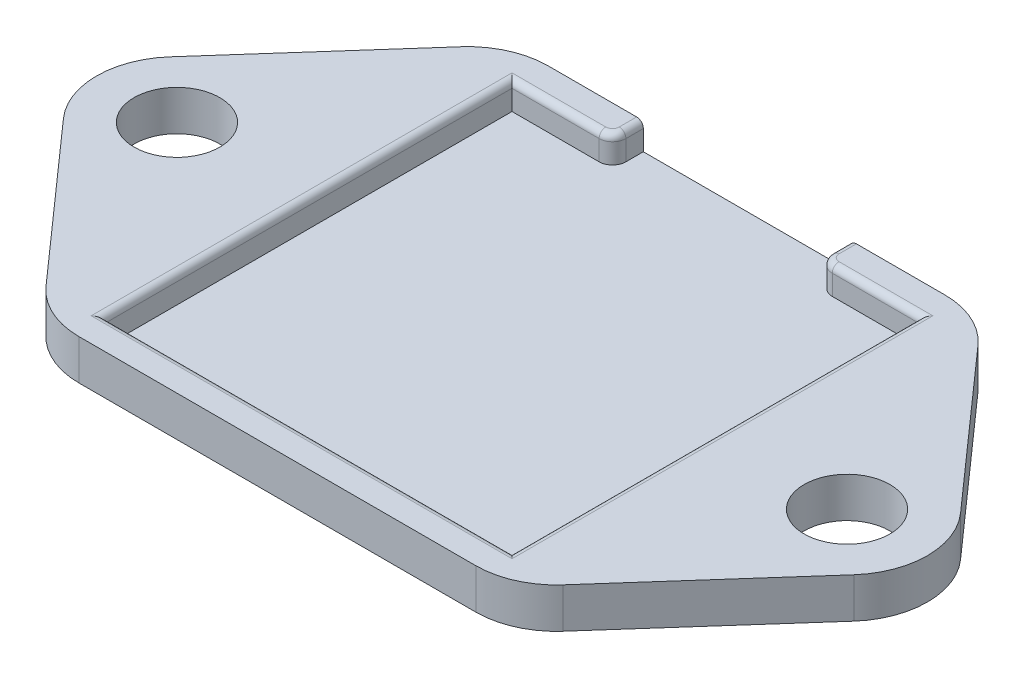
ISO-10303-21;
HEADER;
FILE_DESCRIPTION(('STEP AP214'),'2;1');
FILE_NAME('part.step','',(''),(''),'','','');
FILE_SCHEMA(('AUTOMOTIVE_DESIGN { 1 0 10303 214 1 1 1 1 }'));
ENDSEC;
DATA;
#1=APPLICATION_CONTEXT('core data for automotive mechanical design processes');
#2=APPLICATION_PROTOCOL_DEFINITION('international standard','automotive_design',2000,#1);
#3=PRODUCT_CONTEXT('',#1,'mechanical');
#4=PRODUCT('Part','Part','',(#3));
#5=PRODUCT_RELATED_PRODUCT_CATEGORY('part','',(#4));
#6=PRODUCT_DEFINITION_FORMATION('','',#4);
#7=PRODUCT_DEFINITION_CONTEXT('part definition',#1,'design');
#8=PRODUCT_DEFINITION('design','',#6,#7);
#9=PRODUCT_DEFINITION_SHAPE('','',#8);
#10=(LENGTH_UNIT() NAMED_UNIT(*) SI_UNIT(.MILLI.,.METRE.));
#11=(NAMED_UNIT(*) PLANE_ANGLE_UNIT() SI_UNIT($,.RADIAN.));
#12=(NAMED_UNIT(*) SI_UNIT($,.STERADIAN.) SOLID_ANGLE_UNIT());
#13=UNCERTAINTY_MEASURE_WITH_UNIT(LENGTH_MEASURE(1.E-05),#10,'distance_accuracy_value','');
#14=(GEOMETRIC_REPRESENTATION_CONTEXT(3) GLOBAL_UNCERTAINTY_ASSIGNED_CONTEXT((#13)) GLOBAL_UNIT_ASSIGNED_CONTEXT((#10,
#11,#12)) REPRESENTATION_CONTEXT('',''));
#15=CARTESIAN_POINT('',(0.,0.,0.));
#16=DIRECTION('',(0.,0.,1.));
#17=DIRECTION('',(1.,0.,0.));
#18=AXIS2_PLACEMENT_3D('',#15,#16,#17);
#19=CARTESIAN_POINT('',(25.,3.,0.));
#20=DIRECTION('',(0.,-1.,0.));
#21=DIRECTION('',(0.,0.,-1.));
#22=AXIS2_PLACEMENT_3D('',#19,#20,#21);
#23=PLANE('',#22);
#24=CARTESIAN_POINT('',(-8.7,3.,-16.2));
#25=DIRECTION('',(0.,-1.,0.));
#26=DIRECTION('',(0.,0.,-1.));
#27=AXIS2_PLACEMENT_3D('',#24,#25,#26);
#28=CIRCLE('',#27,0.5);
#29=CARTESIAN_POINT('',(-8.7,3.,-15.7));
#30=VERTEX_POINT('',#29);
#31=CARTESIAN_POINT('',(-8.2,3.,-16.2));
#32=VERTEX_POINT('',#31);
#33=EDGE_CURVE('E479',#30,#32,#28,.F.);
#34=ORIENTED_EDGE('',*,*,#33,.T.);
#35=DIRECTION('',(0.,0.,1.));
#36=VECTOR('',#35,1.);
#37=CARTESIAN_POINT('',(-8.2,3.,0.));
#38=LINE('',#37,#36);
#39=CARTESIAN_POINT('',(-8.2,3.,-17.5));
#40=VERTEX_POINT('',#39);
#41=EDGE_CURVE('E482',#32,#40,#38,.F.);
#42=ORIENTED_EDGE('',*,*,#41,.T.);
#43=DIRECTION('',(-1.,0.,0.));
#44=VECTOR('',#43,1.);
#45=CARTESIAN_POINT('',(-17.5,3.,-17.5));
#46=LINE('',#45,#44);
#47=CARTESIAN_POINT('',(-14.8014525107423,3.,-17.5));
#48=VERTEX_POINT('',#47);
#49=EDGE_CURVE('E314',#40,#48,#46,.T.);
#50=ORIENTED_EDGE('',*,*,#49,.T.);
#51=CARTESIAN_POINT('',(-14.8014525107423,3.,-11.5));
#52=DIRECTION('',(0.,-1.,0.));
#53=DIRECTION('',(0.,0.,-1.));
#54=AXIS2_PLACEMENT_3D('',#51,#52,#53);
#55=CIRCLE('',#54,6.);
#56=CARTESIAN_POINT('',(-19.2904943175209,3.,-15.4810179171908));
#57=VERTEX_POINT('',#56);
#58=EDGE_CURVE('E405',#48,#57,#55,.F.);
#59=ORIENTED_EDGE('',*,*,#58,.T.);
#60=DIRECTION('',(-0.663502986198468,0.,0.748173634463094));
#61=VECTOR('',#60,1.);
#62=CARTESIAN_POINT('',(-17.5,3.,-17.5));
#63=LINE('',#62,#61);
#64=CARTESIAN_POINT('',(-29.4890418067786,3.,-3.98101791719081));
#65=VERTEX_POINT('',#64);
#66=EDGE_CURVE('E320',#57,#65,#63,.T.);
#67=ORIENTED_EDGE('',*,*,#66,.T.);
#68=CARTESIAN_POINT('',(-25.,3.,0.));
#69=DIRECTION('',(0.,1.,0.));
#70=DIRECTION('',(0.,0.,1.));
#71=AXIS2_PLACEMENT_3D('',#68,#69,#70);
#72=CIRCLE('',#71,6.);
#73=CARTESIAN_POINT('',(-29.4890418067786,3.,3.9810179171908));
#74=VERTEX_POINT('',#73);
#75=EDGE_CURVE('E323',#65,#74,#72,.T.);
#76=ORIENTED_EDGE('',*,*,#75,.T.);
#77=DIRECTION('',(0.663502986198469,0.,0.748173634463094));
#78=VECTOR('',#77,1.);
#79=CARTESIAN_POINT('',(-29.4890418067786,3.,3.98101791719081));
#80=LINE('',#79,#78);
#81=CARTESIAN_POINT('',(-19.2904943175209,3.,15.4810179171908));
#82=VERTEX_POINT('',#81);
#83=EDGE_CURVE('E326',#74,#82,#80,.T.);
#84=ORIENTED_EDGE('',*,*,#83,.T.);
#85=CARTESIAN_POINT('',(-14.8014525107423,3.,11.5));
#86=DIRECTION('',(0.,-1.,0.));
#87=DIRECTION('',(0.,0.,-1.));
#88=AXIS2_PLACEMENT_3D('',#85,#86,#87);
#89=CIRCLE('',#88,6.);
#90=CARTESIAN_POINT('',(-14.8014525107423,3.,17.5));
#91=VERTEX_POINT('',#90);
#92=EDGE_CURVE('E408',#82,#91,#89,.F.);
#93=ORIENTED_EDGE('',*,*,#92,.T.);
#94=DIRECTION('',(1.,0.,0.));
#95=VECTOR('',#94,1.);
#96=CARTESIAN_POINT('',(-17.5,3.,17.5));
#97=LINE('',#96,#95);
#98=CARTESIAN_POINT('',(14.8014525107423,3.,17.5));
#99=VERTEX_POINT('',#98);
#100=EDGE_CURVE('E330',#91,#99,#97,.T.);
#101=ORIENTED_EDGE('',*,*,#100,.T.);
#102=CARTESIAN_POINT('',(14.8014525107423,3.,11.5));
#103=DIRECTION('',(0.,-1.,0.));
#104=DIRECTION('',(0.,0.,-1.));
#105=AXIS2_PLACEMENT_3D('',#102,#103,#104);
#106=CIRCLE('',#105,6.);
#107=CARTESIAN_POINT('',(19.2904943175209,3.,15.4810179171908));
#108=VERTEX_POINT('',#107);
#109=EDGE_CURVE('E411',#99,#108,#106,.F.);
#110=ORIENTED_EDGE('',*,*,#109,.T.);
#111=DIRECTION('',(0.663502986198469,0.,-0.748173634463094));
#112=VECTOR('',#111,1.);
#113=CARTESIAN_POINT('',(29.4890418067786,3.,3.98101791719081));
#114=LINE('',#113,#112);
#115=CARTESIAN_POINT('',(29.4890418067786,3.,3.98101791719081));
#116=VERTEX_POINT('',#115);
#117=EDGE_CURVE('E334',#108,#116,#114,.T.);
#118=ORIENTED_EDGE('',*,*,#117,.T.);
#119=CARTESIAN_POINT('',(25.,3.,0.));
#120=DIRECTION('',(0.,1.,0.));
#121=DIRECTION('',(0.,0.,-1.));
#122=AXIS2_PLACEMENT_3D('',#119,#120,#121);
#123=CIRCLE('',#122,6.);
#124=CARTESIAN_POINT('',(29.4890418067786,3.,-3.98101791719081));
#125=VERTEX_POINT('',#124);
#126=EDGE_CURVE('E337',#116,#125,#123,.T.);
#127=ORIENTED_EDGE('',*,*,#126,.T.);
#128=DIRECTION('',(-0.663502986198468,0.,-0.748173634463094));
#129=VECTOR('',#128,1.);
#130=CARTESIAN_POINT('',(17.5,3.,-17.5));
#131=LINE('',#130,#129);
#132=CARTESIAN_POINT('',(19.2904943175209,3.,-15.4810179171908));
#133=VERTEX_POINT('',#132);
#134=EDGE_CURVE('E310',#125,#133,#131,.T.);
#135=ORIENTED_EDGE('',*,*,#134,.T.);
#136=CARTESIAN_POINT('',(14.8014525107423,3.,-11.5));
#137=DIRECTION('',(0.,-1.,0.));
#138=DIRECTION('',(0.,0.,-1.));
#139=AXIS2_PLACEMENT_3D('',#136,#137,#138);
#140=CIRCLE('',#139,6.);
#141=CARTESIAN_POINT('',(14.8014525107423,3.,-17.5));
#142=VERTEX_POINT('',#141);
#143=EDGE_CURVE('E414',#133,#142,#140,.F.);
#144=ORIENTED_EDGE('',*,*,#143,.T.);
#145=CARTESIAN_POINT('',(8.2,3.,-17.5));
#146=VERTEX_POINT('',#145);
#147=EDGE_CURVE('E316',#142,#146,#46,.T.);
#148=ORIENTED_EDGE('',*,*,#147,.T.);
#149=DIRECTION('',(0.,0.,-1.));
#150=VECTOR('',#149,1.);
#151=CARTESIAN_POINT('',(8.2,3.,0.));
#152=LINE('',#151,#150);
#153=CARTESIAN_POINT('',(8.2,3.,-16.2));
#154=VERTEX_POINT('',#153);
#155=EDGE_CURVE('E476',#146,#154,#152,.F.);
#156=ORIENTED_EDGE('',*,*,#155,.T.);
#157=CARTESIAN_POINT('',(8.7,3.,-16.2));
#158=DIRECTION('',(0.,-1.,0.));
#159=DIRECTION('',(0.,0.,-1.));
#160=AXIS2_PLACEMENT_3D('',#157,#158,#159);
#161=CIRCLE('',#160,0.5);
#162=CARTESIAN_POINT('',(8.7,3.,-15.7));
#163=VERTEX_POINT('',#162);
#164=EDGE_CURVE('E473',#154,#163,#161,.F.);
#165=ORIENTED_EDGE('',*,*,#164,.T.);
#166=DIRECTION('',(-1.,0.,0.));
#167=VECTOR('',#166,1.);
#168=CARTESIAN_POINT('',(25.,3.,-15.7));
#169=LINE('',#168,#167);
#170=CARTESIAN_POINT('',(15.7,3.,-15.7));
#171=VERTEX_POINT('',#170);
#172=EDGE_CURVE('E467',#163,#171,#169,.F.);
#173=ORIENTED_EDGE('',*,*,#172,.T.);
#174=DIRECTION('',(0.,0.,-1.));
#175=VECTOR('',#174,1.);
#176=CARTESIAN_POINT('',(15.7,3.,0.));
#177=LINE('',#176,#175);
#178=CARTESIAN_POINT('',(15.7,3.,15.7));
#179=VERTEX_POINT('',#178);
#180=EDGE_CURVE('E464',#171,#179,#177,.F.);
#181=ORIENTED_EDGE('',*,*,#180,.T.);
#182=DIRECTION('',(1.,0.,0.));
#183=VECTOR('',#182,1.);
#184=CARTESIAN_POINT('',(25.,3.,15.7));
#185=LINE('',#184,#183);
#186=CARTESIAN_POINT('',(-15.7,3.,15.7));
#187=VERTEX_POINT('',#186);
#188=EDGE_CURVE('E461',#179,#187,#185,.F.);
#189=ORIENTED_EDGE('',*,*,#188,.T.);
#190=DIRECTION('',(0.,0.,1.));
#191=VECTOR('',#190,1.);
#192=CARTESIAN_POINT('',(-15.7,3.,0.));
#193=LINE('',#192,#191);
#194=CARTESIAN_POINT('',(-15.7,3.,-15.7));
#195=VERTEX_POINT('',#194);
#196=EDGE_CURVE('E458',#187,#195,#193,.F.);
#197=ORIENTED_EDGE('',*,*,#196,.T.);
#198=DIRECTION('',(-1.,0.,0.));
#199=VECTOR('',#198,1.);
#200=CARTESIAN_POINT('',(25.,3.,-15.7));
#201=LINE('',#200,#199);
#202=EDGE_CURVE('E470',#195,#30,#201,.F.);
#203=ORIENTED_EDGE('',*,*,#202,.T.);
#204=EDGE_LOOP('',(#34,#42,#50,#59,#67,#76,#84,#93,#101,#110,#118,#127,#135,#144,#148,#156,#165,
#173,#181,#189,#197,#203));
#205=FACE_BOUND('',#204,.T.);
#206=CARTESIAN_POINT('',(-25.,3.,0.));
#207=DIRECTION('',(0.,1.,0.));
#208=DIRECTION('',(0.,0.,1.));
#209=AXIS2_PLACEMENT_3D('',#206,#207,#208);
#210=CIRCLE('',#209,3.2);
#211=CARTESIAN_POINT('',(-25.,3.,3.2));
#212=VERTEX_POINT('',#211);
#213=EDGE_CURVE('E302',#212,#212,#210,.T.);
#214=ORIENTED_EDGE('',*,*,#213,.F.);
#215=EDGE_LOOP('',(#214));
#216=FACE_BOUND('',#215,.T.);
#217=CARTESIAN_POINT('',(25.,3.,0.));
#218=DIRECTION('',(0.,1.,0.));
#219=DIRECTION('',(0.,0.,-1.));
#220=AXIS2_PLACEMENT_3D('',#217,#218,#219);
#221=CIRCLE('',#220,3.2);
#222=CARTESIAN_POINT('',(25.,3.,-3.2));
#223=VERTEX_POINT('',#222);
#224=EDGE_CURVE('E294',#223,#223,#221,.T.);
#225=ORIENTED_EDGE('',*,*,#224,.F.);
#226=EDGE_LOOP('',(#225));
#227=FACE_BOUND('',#226,.T.);
#228=ADVANCED_FACE('F46',(#205,#216,#227),#23,.F.);
#229=CARTESIAN_POINT('',(25.,0.,0.));
#230=DIRECTION('',(0.,-1.,0.));
#231=DIRECTION('',(0.,0.,-1.));
#232=AXIS2_PLACEMENT_3D('',#229,#230,#231);
#233=PLANE('',#232);
#234=CARTESIAN_POINT('',(-25.,0.,0.));
#235=DIRECTION('',(0.,1.,0.));
#236=DIRECTION('',(0.,0.,1.));
#237=AXIS2_PLACEMENT_3D('',#234,#235,#236);
#238=CIRCLE('',#237,3.2);
#239=CARTESIAN_POINT('',(-25.,0.,3.2));
#240=VERTEX_POINT('',#239);
#241=EDGE_CURVE('E298',#240,#240,#238,.T.);
#242=ORIENTED_EDGE('',*,*,#241,.T.);
#243=EDGE_LOOP('',(#242));
#244=FACE_BOUND('',#243,.T.);
#245=DIRECTION('',(-1.,0.,0.));
#246=VECTOR('',#245,1.);
#247=CARTESIAN_POINT('',(-17.5,0.,-17.5));
#248=LINE('',#247,#246);
#249=CARTESIAN_POINT('',(14.8014525107423,0.,-17.5));
#250=VERTEX_POINT('',#249);
#251=CARTESIAN_POINT('',(-14.8014525107423,0.,-17.5));
#252=VERTEX_POINT('',#251);
#253=EDGE_CURVE('E344',#250,#252,#248,.T.);
#254=ORIENTED_EDGE('',*,*,#253,.F.);
#255=CARTESIAN_POINT('',(14.8014525107423,0.,-11.5));
#256=DIRECTION('',(0.,-1.,0.));
#257=DIRECTION('',(0.,0.,-1.));
#258=AXIS2_PLACEMENT_3D('',#255,#256,#257);
#259=CIRCLE('',#258,6.);
#260=CARTESIAN_POINT('',(19.2904943175209,0.,-15.4810179171908));
#261=VERTEX_POINT('',#260);
#262=EDGE_CURVE('E399',#250,#261,#259,.T.);
#263=ORIENTED_EDGE('',*,*,#262,.T.);
#264=DIRECTION('',(-0.663502986198468,0.,-0.748173634463094));
#265=VECTOR('',#264,1.);
#266=CARTESIAN_POINT('',(17.5,0.,-17.5));
#267=LINE('',#266,#265);
#268=CARTESIAN_POINT('',(29.4890418067786,0.,-3.98101791719081));
#269=VERTEX_POINT('',#268);
#270=EDGE_CURVE('E306',#269,#261,#267,.T.);
#271=ORIENTED_EDGE('',*,*,#270,.F.);
#272=CARTESIAN_POINT('',(25.,0.,0.));
#273=DIRECTION('',(0.,1.,0.));
#274=DIRECTION('',(0.,0.,-1.));
#275=AXIS2_PLACEMENT_3D('',#272,#273,#274);
#276=CIRCLE('',#275,6.);
#277=CARTESIAN_POINT('',(29.4890418067786,0.,3.98101791719081));
#278=VERTEX_POINT('',#277);
#279=EDGE_CURVE('E315',#278,#269,#276,.T.);
#280=ORIENTED_EDGE('',*,*,#279,.F.);
#281=DIRECTION('',(0.663502986198469,0.,-0.748173634463094));
#282=VECTOR('',#281,1.);
#283=CARTESIAN_POINT('',(29.4890418067786,0.,3.98101791719081));
#284=LINE('',#283,#282);
#285=CARTESIAN_POINT('',(19.2904943175209,0.,15.4810179171908));
#286=VERTEX_POINT('',#285);
#287=EDGE_CURVE('E362',#286,#278,#284,.T.);
#288=ORIENTED_EDGE('',*,*,#287,.F.);
#289=CARTESIAN_POINT('',(14.8014525107423,0.,11.5));
#290=DIRECTION('',(0.,-1.,0.));
#291=DIRECTION('',(0.,0.,-1.));
#292=AXIS2_PLACEMENT_3D('',#289,#290,#291);
#293=CIRCLE('',#292,6.);
#294=CARTESIAN_POINT('',(14.8014525107423,0.,17.5));
#295=VERTEX_POINT('',#294);
#296=EDGE_CURVE('E396',#286,#295,#293,.T.);
#297=ORIENTED_EDGE('',*,*,#296,.T.);
#298=DIRECTION('',(1.,0.,0.));
#299=VECTOR('',#298,1.);
#300=CARTESIAN_POINT('',(-17.5,0.,17.5));
#301=LINE('',#300,#299);
#302=CARTESIAN_POINT('',(-14.8014525107423,0.,17.5));
#303=VERTEX_POINT('',#302);
#304=EDGE_CURVE('E358',#303,#295,#301,.T.);
#305=ORIENTED_EDGE('',*,*,#304,.F.);
#306=CARTESIAN_POINT('',(-14.8014525107423,0.,11.5));
#307=DIRECTION('',(0.,-1.,0.));
#308=DIRECTION('',(0.,0.,-1.));
#309=AXIS2_PLACEMENT_3D('',#306,#307,#308);
#310=CIRCLE('',#309,6.);
#311=CARTESIAN_POINT('',(-19.2904943175209,0.,15.4810179171908));
#312=VERTEX_POINT('',#311);
#313=EDGE_CURVE('E393',#303,#312,#310,.T.);
#314=ORIENTED_EDGE('',*,*,#313,.T.);
#315=DIRECTION('',(0.663502986198469,0.,0.748173634463094));
#316=VECTOR('',#315,1.);
#317=CARTESIAN_POINT('',(-29.4890418067786,0.,3.98101791719081));
#318=LINE('',#317,#316);
#319=CARTESIAN_POINT('',(-29.4890418067786,0.,3.9810179171908));
#320=VERTEX_POINT('',#319);
#321=EDGE_CURVE('E354',#320,#312,#318,.T.);
#322=ORIENTED_EDGE('',*,*,#321,.F.);
#323=CARTESIAN_POINT('',(-25.,0.,0.));
#324=DIRECTION('',(0.,1.,0.));
#325=DIRECTION('',(0.,0.,1.));
#326=AXIS2_PLACEMENT_3D('',#323,#324,#325);
#327=CIRCLE('',#326,6.);
#328=CARTESIAN_POINT('',(-29.4890418067786,0.,-3.98101791719081));
#329=VERTEX_POINT('',#328);
#330=EDGE_CURVE('E351',#329,#320,#327,.T.);
#331=ORIENTED_EDGE('',*,*,#330,.F.);
#332=DIRECTION('',(-0.663502986198468,0.,0.748173634463094));
#333=VECTOR('',#332,1.);
#334=CARTESIAN_POINT('',(-17.5,0.,-17.5));
#335=LINE('',#334,#333);
#336=CARTESIAN_POINT('',(-19.2904943175209,0.,-15.4810179171908));
#337=VERTEX_POINT('',#336);
#338=EDGE_CURVE('E348',#337,#329,#335,.T.);
#339=ORIENTED_EDGE('',*,*,#338,.F.);
#340=CARTESIAN_POINT('',(-14.8014525107423,0.,-11.5));
#341=DIRECTION('',(0.,-1.,0.));
#342=DIRECTION('',(0.,0.,-1.));
#343=AXIS2_PLACEMENT_3D('',#340,#341,#342);
#344=CIRCLE('',#343,6.);
#345=EDGE_CURVE('E390',#337,#252,#344,.T.);
#346=ORIENTED_EDGE('',*,*,#345,.T.);
#347=EDGE_LOOP('',(#254,#263,#271,#280,#288,#297,#305,#314,#322,#331,#339,#346));
#348=FACE_BOUND('',#347,.T.);
#349=CARTESIAN_POINT('',(25.,0.,0.));
#350=DIRECTION('',(0.,1.,0.));
#351=DIRECTION('',(0.,0.,-1.));
#352=AXIS2_PLACEMENT_3D('',#349,#350,#351);
#353=CIRCLE('',#352,3.2);
#354=CARTESIAN_POINT('',(25.,0.,-3.2));
#355=VERTEX_POINT('',#354);
#356=EDGE_CURVE('E280',#355,#355,#353,.T.);
#357=ORIENTED_EDGE('',*,*,#356,.T.);
#358=EDGE_LOOP('',(#357));
#359=FACE_BOUND('',#358,.T.);
#360=ADVANCED_FACE('F571',(#244,#348,#359),#233,.T.);
#361=CARTESIAN_POINT('',(17.5,3.,-17.5));
#362=DIRECTION('',(-0.748173634463094,0.,0.663502986198468));
#363=DIRECTION('',(0.663502986198468,0.,0.748173634463094));
#364=AXIS2_PLACEMENT_3D('',#361,#362,#363);
#365=PLANE('',#364);
#366=ORIENTED_EDGE('',*,*,#270,.T.);
#367=DIRECTION('',(0.,-1.,0.));
#368=VECTOR('',#367,1.);
#369=CARTESIAN_POINT('',(19.2904943175209,3.,-15.4810179171908));
#370=LINE('',#369,#368);
#371=EDGE_CURVE('E402',#261,#133,#370,.F.);
#372=ORIENTED_EDGE('',*,*,#371,.T.);
#373=ORIENTED_EDGE('',*,*,#134,.F.);
#374=DIRECTION('',(0.,-1.,0.));
#375=VECTOR('',#374,1.);
#376=CARTESIAN_POINT('',(29.4890418067786,3.,-3.98101791719081));
#377=LINE('',#376,#375);
#378=EDGE_CURVE('E340',#125,#269,#377,.T.);
#379=ORIENTED_EDGE('',*,*,#378,.T.);
#380=EDGE_LOOP('',(#366,#372,#373,#379));
#381=FACE_BOUND('',#380,.T.);
#382=ADVANCED_FACE('F644',(#381),#365,.F.);
#383=CARTESIAN_POINT('',(-17.5,3.,-17.5));
#384=DIRECTION('',(0.,0.,1.));
#385=DIRECTION('',(1.,0.,0.));
#386=AXIS2_PLACEMENT_3D('',#383,#384,#385);
#387=PLANE('',#386);
#388=ORIENTED_EDGE('',*,*,#49,.F.);
#389=CARTESIAN_POINT('',(-8.2,2.5,-17.5));
#390=DIRECTION('',(0.,0.,1.));
#391=DIRECTION('',(1.,0.,0.));
#392=AXIS2_PLACEMENT_3D('',#389,#390,#391);
#393=CIRCLE('',#392,0.5);
#394=CARTESIAN_POINT('',(-7.7,2.5,-17.5));
#395=VERTEX_POINT('',#394);
#396=EDGE_CURVE('E488',#40,#395,#393,.F.);
#397=ORIENTED_EDGE('',*,*,#396,.T.);
#398=DIRECTION('',(0.,1.,0.));
#399=VECTOR('',#398,1.);
#400=CARTESIAN_POINT('',(-7.7,1.,-17.5));
#401=LINE('',#400,#399);
#402=CARTESIAN_POINT('',(-7.7,1.,-17.5));
#403=VERTEX_POINT('',#402);
#404=EDGE_CURVE('E287',#403,#395,#401,.T.);
#405=ORIENTED_EDGE('',*,*,#404,.F.);
#406=DIRECTION('',(-1.,0.,0.));
#407=VECTOR('',#406,1.);
#408=CARTESIAN_POINT('',(-7.7,1.,-17.5));
#409=LINE('',#408,#407);
#410=CARTESIAN_POINT('',(7.7,1.,-17.5));
#411=VERTEX_POINT('',#410);
#412=EDGE_CURVE('E261',#411,#403,#409,.T.);
#413=ORIENTED_EDGE('',*,*,#412,.F.);
#414=DIRECTION('',(0.,1.,0.));
#415=VECTOR('',#414,1.);
#416=CARTESIAN_POINT('',(7.7,1.,-17.5));
#417=LINE('',#416,#415);
#418=CARTESIAN_POINT('',(7.7,2.5,-17.5));
#419=VERTEX_POINT('',#418);
#420=EDGE_CURVE('E237',#411,#419,#417,.T.);
#421=ORIENTED_EDGE('',*,*,#420,.T.);
#422=CARTESIAN_POINT('',(8.2,2.5,-17.5));
#423=DIRECTION('',(0.,0.,1.));
#424=DIRECTION('',(1.,0.,0.));
#425=AXIS2_PLACEMENT_3D('',#422,#423,#424);
#426=CIRCLE('',#425,0.5);
#427=EDGE_CURVE('E485',#419,#146,#426,.F.);
#428=ORIENTED_EDGE('',*,*,#427,.T.);
#429=ORIENTED_EDGE('',*,*,#147,.F.);
#430=DIRECTION('',(0.,-1.,0.));
#431=VECTOR('',#430,1.);
#432=CARTESIAN_POINT('',(14.8014525107423,3.,-17.5));
#433=LINE('',#432,#431);
#434=EDGE_CURVE('E386',#142,#250,#433,.T.);
#435=ORIENTED_EDGE('',*,*,#434,.T.);
#436=ORIENTED_EDGE('',*,*,#253,.T.);
#437=DIRECTION('',(0.,-1.,0.));
#438=VECTOR('',#437,1.);
#439=CARTESIAN_POINT('',(-14.8014525107423,3.,-17.5));
#440=LINE('',#439,#438);
#441=EDGE_CURVE('E382',#252,#48,#440,.F.);
#442=ORIENTED_EDGE('',*,*,#441,.T.);
#443=EDGE_LOOP('',(#388,#397,#405,#413,#421,#428,#429,#435,#436,#442));
#444=FACE_BOUND('',#443,.T.);
#445=ADVANCED_FACE('F558',(#444),#387,.F.);
#446=CARTESIAN_POINT('',(-17.5,3.,-17.5));
#447=DIRECTION('',(0.748173634463094,0.,0.663502986198468));
#448=DIRECTION('',(0.663502986198468,0.,-0.748173634463094));
#449=AXIS2_PLACEMENT_3D('',#446,#447,#448);
#450=PLANE('',#449);
#451=ORIENTED_EDGE('',*,*,#66,.F.);
#452=DIRECTION('',(0.,-1.,0.));
#453=VECTOR('',#452,1.);
#454=CARTESIAN_POINT('',(-19.2904943175209,3.,-15.4810179171908));
#455=LINE('',#454,#453);
#456=EDGE_CURVE('E431',#57,#337,#455,.T.);
#457=ORIENTED_EDGE('',*,*,#456,.T.);
#458=ORIENTED_EDGE('',*,*,#338,.T.);
#459=DIRECTION('',(0.,-1.,0.));
#460=VECTOR('',#459,1.);
#461=CARTESIAN_POINT('',(-29.4890418067786,3.,-3.98101791719081));
#462=LINE('',#461,#460);
#463=EDGE_CURVE('E378',#65,#329,#462,.T.);
#464=ORIENTED_EDGE('',*,*,#463,.F.);
#465=EDGE_LOOP('',(#451,#457,#458,#464));
#466=FACE_BOUND('',#465,.T.);
#467=ADVANCED_FACE('F582',(#466),#450,.F.);
#468=CARTESIAN_POINT('',(-25.,3.,0.));
#469=DIRECTION('',(0.,-1.,0.));
#470=DIRECTION('',(0.,0.,-1.));
#471=AXIS2_PLACEMENT_3D('',#468,#469,#470);
#472=CYLINDRICAL_SURFACE('',#471,6.);
#473=ORIENTED_EDGE('',*,*,#330,.T.);
#474=DIRECTION('',(0.,-1.,0.));
#475=VECTOR('',#474,1.);
#476=CARTESIAN_POINT('',(-29.4890418067786,3.,3.9810179171908));
#477=LINE('',#476,#475);
#478=EDGE_CURVE('E374',#74,#320,#477,.T.);
#479=ORIENTED_EDGE('',*,*,#478,.F.);
#480=ORIENTED_EDGE('',*,*,#75,.F.);
#481=ORIENTED_EDGE('',*,*,#463,.T.);
#482=EDGE_LOOP('',(#473,#479,#480,#481));
#483=FACE_BOUND('',#482,.T.);
#484=ADVANCED_FACE('F666',(#483),#472,.T.);
#485=CARTESIAN_POINT('',(-29.4890418067786,3.,3.98101791719081));
#486=DIRECTION('',(0.748173634463094,0.,-0.663502986198469));
#487=DIRECTION('',(-0.663502986198469,0.,-0.748173634463094));
#488=AXIS2_PLACEMENT_3D('',#485,#486,#487);
#489=PLANE('',#488);
#490=ORIENTED_EDGE('',*,*,#321,.T.);
#491=DIRECTION('',(0.,-1.,0.));
#492=VECTOR('',#491,1.);
#493=CARTESIAN_POINT('',(-19.2904943175209,3.,15.4810179171908));
#494=LINE('',#493,#492);
#495=EDGE_CURVE('E428',#312,#82,#494,.F.);
#496=ORIENTED_EDGE('',*,*,#495,.T.);
#497=ORIENTED_EDGE('',*,*,#83,.F.);
#498=ORIENTED_EDGE('',*,*,#478,.T.);
#499=EDGE_LOOP('',(#490,#496,#497,#498));
#500=FACE_BOUND('',#499,.T.);
#501=ADVANCED_FACE('F662',(#500),#489,.F.);
#502=CARTESIAN_POINT('',(-17.5,3.,17.5));
#503=DIRECTION('',(0.,0.,-1.));
#504=DIRECTION('',(-1.,0.,0.));
#505=AXIS2_PLACEMENT_3D('',#502,#503,#504);
#506=PLANE('',#505);
#507=ORIENTED_EDGE('',*,*,#304,.T.);
#508=DIRECTION('',(0.,-1.,0.));
#509=VECTOR('',#508,1.);
#510=CARTESIAN_POINT('',(14.8014525107423,3.,17.5));
#511=LINE('',#510,#509);
#512=EDGE_CURVE('E425',#295,#99,#511,.F.);
#513=ORIENTED_EDGE('',*,*,#512,.T.);
#514=ORIENTED_EDGE('',*,*,#100,.F.);
#515=DIRECTION('',(0.,-1.,0.));
#516=VECTOR('',#515,1.);
#517=CARTESIAN_POINT('',(-14.8014525107423,3.,17.5));
#518=LINE('',#517,#516);
#519=EDGE_CURVE('E421',#91,#303,#518,.T.);
#520=ORIENTED_EDGE('',*,*,#519,.T.);
#521=EDGE_LOOP('',(#507,#513,#514,#520));
#522=FACE_BOUND('',#521,.T.);
#523=ADVANCED_FACE('F658',(#522),#506,.F.);
#524=CARTESIAN_POINT('',(29.4890418067786,3.,3.98101791719081));
#525=DIRECTION('',(-0.748173634463094,0.,-0.663502986198469));
#526=DIRECTION('',(-0.663502986198469,0.,0.748173634463094));
#527=AXIS2_PLACEMENT_3D('',#524,#525,#526);
#528=PLANE('',#527);
#529=ORIENTED_EDGE('',*,*,#117,.F.);
#530=DIRECTION('',(0.,-1.,0.));
#531=VECTOR('',#530,1.);
#532=CARTESIAN_POINT('',(19.2904943175209,3.,15.4810179171908));
#533=LINE('',#532,#531);
#534=EDGE_CURVE('E417',#108,#286,#533,.T.);
#535=ORIENTED_EDGE('',*,*,#534,.T.);
#536=ORIENTED_EDGE('',*,*,#287,.T.);
#537=DIRECTION('',(0.,-1.,0.));
#538=VECTOR('',#537,1.);
#539=CARTESIAN_POINT('',(29.4890418067786,3.,3.98101791719081));
#540=LINE('',#539,#538);
#541=EDGE_CURVE('E370',#116,#278,#540,.T.);
#542=ORIENTED_EDGE('',*,*,#541,.F.);
#543=EDGE_LOOP('',(#529,#535,#536,#542));
#544=FACE_BOUND('',#543,.T.);
#545=ADVANCED_FACE('F654',(#544),#528,.F.);
#546=CARTESIAN_POINT('',(25.,3.,0.));
#547=DIRECTION('',(0.,-1.,0.));
#548=DIRECTION('',(0.,0.,-1.));
#549=AXIS2_PLACEMENT_3D('',#546,#547,#548);
#550=CYLINDRICAL_SURFACE('',#549,6.);
#551=ORIENTED_EDGE('',*,*,#279,.T.);
#552=ORIENTED_EDGE('',*,*,#378,.F.);
#553=ORIENTED_EDGE('',*,*,#126,.F.);
#554=ORIENTED_EDGE('',*,*,#541,.T.);
#555=EDGE_LOOP('',(#551,#552,#553,#554));
#556=FACE_BOUND('',#555,.T.);
#557=ADVANCED_FACE('F651',(#556),#550,.T.);
#558=CARTESIAN_POINT('',(-25.,3.,0.));
#559=DIRECTION('',(0.,-1.,0.));
#560=DIRECTION('',(0.,0.,-1.));
#561=AXIS2_PLACEMENT_3D('',#558,#559,#560);
#562=CYLINDRICAL_SURFACE('',#561,3.2);
#563=ORIENTED_EDGE('',*,*,#213,.T.);
#564=EDGE_LOOP('',(#563));
#565=FACE_BOUND('',#564,.T.);
#566=ORIENTED_EDGE('',*,*,#241,.F.);
#567=EDGE_LOOP('',(#566));
#568=FACE_BOUND('',#567,.T.);
#569=ADVANCED_FACE('F648',(#565,#568),#562,.F.);
#570=CARTESIAN_POINT('',(25.,3.,0.));
#571=DIRECTION('',(0.,-1.,0.));
#572=DIRECTION('',(0.,0.,-1.));
#573=AXIS2_PLACEMENT_3D('',#570,#571,#572);
#574=CYLINDRICAL_SURFACE('',#573,3.2);
#575=ORIENTED_EDGE('',*,*,#224,.T.);
#576=EDGE_LOOP('',(#575));
#577=FACE_BOUND('',#576,.T.);
#578=ORIENTED_EDGE('',*,*,#356,.F.);
#579=EDGE_LOOP('',(#578));
#580=FACE_BOUND('',#579,.T.);
#581=ADVANCED_FACE('F842',(#577,#580),#574,.F.);
#582=CARTESIAN_POINT('',(15.2,1.,-15.2));
#583=DIRECTION('',(1.,0.,0.));
#584=DIRECTION('',(0.,0.,-1.));
#585=AXIS2_PLACEMENT_3D('',#582,#583,#584);
#586=PLANE('',#585);
#587=DIRECTION('',(0.,1.,0.));
#588=VECTOR('',#587,1.);
#589=CARTESIAN_POINT('',(15.2,1.,15.2));
#590=LINE('',#589,#588);
#591=CARTESIAN_POINT('',(15.2,1.,15.2));
#592=VERTEX_POINT('',#591);
#593=CARTESIAN_POINT('',(15.2,2.5,15.2));
#594=VERTEX_POINT('',#593);
#595=EDGE_CURVE('E277',#592,#594,#590,.T.);
#596=ORIENTED_EDGE('',*,*,#595,.T.);
#597=DIRECTION('',(0.,0.,-1.));
#598=VECTOR('',#597,1.);
#599=CARTESIAN_POINT('',(15.2,2.5,-15.2));
#600=LINE('',#599,#598);
#601=CARTESIAN_POINT('',(15.2,2.5,-15.2));
#602=VERTEX_POINT('',#601);
#603=EDGE_CURVE('E233',#594,#602,#600,.T.);
#604=ORIENTED_EDGE('',*,*,#603,.T.);
#605=DIRECTION('',(0.,1.,0.));
#606=VECTOR('',#605,1.);
#607=CARTESIAN_POINT('',(15.2,1.,-15.2));
#608=LINE('',#607,#606);
#609=CARTESIAN_POINT('',(15.2,1.,-15.2));
#610=VERTEX_POINT('',#609);
#611=EDGE_CURVE('E226',#610,#602,#608,.T.);
#612=ORIENTED_EDGE('',*,*,#611,.F.);
#613=DIRECTION('',(0.,0.,-1.));
#614=VECTOR('',#613,1.);
#615=CARTESIAN_POINT('',(15.2,1.,-15.2));
#616=LINE('',#615,#614);
#617=EDGE_CURVE('E230',#592,#610,#616,.T.);
#618=ORIENTED_EDGE('',*,*,#617,.F.);
#619=EDGE_LOOP('',(#596,#604,#612,#618));
#620=FACE_BOUND('',#619,.T.);
#621=ADVANCED_FACE('F228',(#620),#586,.F.);
#622=CARTESIAN_POINT('',(-15.2,1.,15.2));
#623=DIRECTION('',(0.,0.,1.));
#624=DIRECTION('',(1.,0.,0.));
#625=AXIS2_PLACEMENT_3D('',#622,#623,#624);
#626=PLANE('',#625);
#627=DIRECTION('',(0.,1.,0.));
#628=VECTOR('',#627,1.);
#629=CARTESIAN_POINT('',(-15.2,1.,15.2));
#630=LINE('',#629,#628);
#631=CARTESIAN_POINT('',(-15.2,1.,15.2));
#632=VERTEX_POINT('',#631);
#633=CARTESIAN_POINT('',(-15.2,2.5,15.2));
#634=VERTEX_POINT('',#633);
#635=EDGE_CURVE('E281',#632,#634,#630,.T.);
#636=ORIENTED_EDGE('',*,*,#635,.T.);
#637=DIRECTION('',(1.,0.,0.));
#638=VECTOR('',#637,1.);
#639=CARTESIAN_POINT('',(-15.2,2.5,15.2));
#640=LINE('',#639,#638);
#641=EDGE_CURVE('E56',#634,#594,#640,.T.);
#642=ORIENTED_EDGE('',*,*,#641,.T.);
#643=ORIENTED_EDGE('',*,*,#595,.F.);
#644=DIRECTION('',(1.,0.,0.));
#645=VECTOR('',#644,1.);
#646=CARTESIAN_POINT('',(-15.2,1.,15.2));
#647=LINE('',#646,#645);
#648=EDGE_CURVE('E238',#632,#592,#647,.T.);
#649=ORIENTED_EDGE('',*,*,#648,.F.);
#650=EDGE_LOOP('',(#636,#642,#643,#649));
#651=FACE_BOUND('',#650,.T.);
#652=ADVANCED_FACE('F609',(#651),#626,.F.);
#653=CARTESIAN_POINT('',(-15.2,1.,-15.2));
#654=DIRECTION('',(-1.,0.,0.));
#655=DIRECTION('',(0.,0.,1.));
#656=AXIS2_PLACEMENT_3D('',#653,#654,#655);
#657=PLANE('',#656);
#658=DIRECTION('',(0.,1.,0.));
#659=VECTOR('',#658,1.);
#660=CARTESIAN_POINT('',(-15.2,1.,-15.2));
#661=LINE('',#660,#659);
#662=CARTESIAN_POINT('',(-15.2,1.,-15.2));
#663=VERTEX_POINT('',#662);
#664=CARTESIAN_POINT('',(-15.2,2.5,-15.2));
#665=VERTEX_POINT('',#664);
#666=EDGE_CURVE('E284',#663,#665,#661,.T.);
#667=ORIENTED_EDGE('',*,*,#666,.T.);
#668=DIRECTION('',(0.,0.,1.));
#669=VECTOR('',#668,1.);
#670=CARTESIAN_POINT('',(-15.2,2.5,-15.2));
#671=LINE('',#670,#669);
#672=EDGE_CURVE('E11',#665,#634,#671,.T.);
#673=ORIENTED_EDGE('',*,*,#672,.T.);
#674=ORIENTED_EDGE('',*,*,#635,.F.);
#675=DIRECTION('',(0.,0.,1.));
#676=VECTOR('',#675,1.);
#677=CARTESIAN_POINT('',(-15.2,1.,-15.2));
#678=LINE('',#677,#676);
#679=EDGE_CURVE('E272',#663,#632,#678,.T.);
#680=ORIENTED_EDGE('',*,*,#679,.F.);
#681=EDGE_LOOP('',(#667,#673,#674,#680));
#682=FACE_BOUND('',#681,.T.);
#683=ADVANCED_FACE('F608',(#682),#657,.F.);
#684=CARTESIAN_POINT('',(-15.2,1.,-15.2));
#685=DIRECTION('',(0.,0.,-1.));
#686=DIRECTION('',(-1.,0.,0.));
#687=AXIS2_PLACEMENT_3D('',#684,#685,#686);
#688=PLANE('',#687);
#689=DIRECTION('',(0.,1.,0.));
#690=VECTOR('',#689,1.);
#691=CARTESIAN_POINT('',(-8.7,1.,-15.2));
#692=LINE('',#691,#690);
#693=CARTESIAN_POINT('',(-8.7,1.,-15.2));
#694=VERTEX_POINT('',#693);
#695=CARTESIAN_POINT('',(-8.7,2.5,-15.2));
#696=VERTEX_POINT('',#695);
#697=EDGE_CURVE('E441',#694,#696,#692,.T.);
#698=ORIENTED_EDGE('',*,*,#697,.T.);
#699=DIRECTION('',(-1.,0.,0.));
#700=VECTOR('',#699,1.);
#701=CARTESIAN_POINT('',(-15.2,2.5,-15.2));
#702=LINE('',#701,#700);
#703=EDGE_CURVE('E500',#696,#665,#702,.T.);
#704=ORIENTED_EDGE('',*,*,#703,.T.);
#705=ORIENTED_EDGE('',*,*,#666,.F.);
#706=DIRECTION('',(-1.,0.,0.));
#707=VECTOR('',#706,1.);
#708=CARTESIAN_POINT('',(-15.2,1.,-15.2));
#709=LINE('',#708,#707);
#710=EDGE_CURVE('E269',#694,#663,#709,.T.);
#711=ORIENTED_EDGE('',*,*,#710,.F.);
#712=EDGE_LOOP('',(#698,#704,#705,#711));
#713=FACE_BOUND('',#712,.T.);
#714=ADVANCED_FACE('F605',(#713),#688,.F.);
#715=CARTESIAN_POINT('',(-7.7,1.,-15.2));
#716=DIRECTION('',(-1.,0.,0.));
#717=DIRECTION('',(0.,0.,1.));
#718=AXIS2_PLACEMENT_3D('',#715,#716,#717);
#719=PLANE('',#718);
#720=ORIENTED_EDGE('',*,*,#404,.T.);
#721=DIRECTION('',(0.,0.,1.));
#722=VECTOR('',#721,1.);
#723=CARTESIAN_POINT('',(-7.7,2.5,-15.2));
#724=LINE('',#723,#722);
#725=CARTESIAN_POINT('',(-7.7,2.5,-16.2));
#726=VERTEX_POINT('',#725);
#727=EDGE_CURVE('E454',#395,#726,#724,.T.);
#728=ORIENTED_EDGE('',*,*,#727,.T.);
#729=DIRECTION('',(0.,1.,0.));
#730=VECTOR('',#729,1.);
#731=CARTESIAN_POINT('',(-7.7,1.,-16.2));
#732=LINE('',#731,#730);
#733=CARTESIAN_POINT('',(-7.7,1.,-16.2));
#734=VERTEX_POINT('',#733);
#735=EDGE_CURVE('E445',#726,#734,#732,.F.);
#736=ORIENTED_EDGE('',*,*,#735,.T.);
#737=DIRECTION('',(0.,0.,1.));
#738=VECTOR('',#737,1.);
#739=CARTESIAN_POINT('',(-7.7,1.,-15.2));
#740=LINE('',#739,#738);
#741=EDGE_CURVE('E265',#403,#734,#740,.T.);
#742=ORIENTED_EDGE('',*,*,#741,.F.);
#743=EDGE_LOOP('',(#720,#728,#736,#742));
#744=FACE_BOUND('',#743,.T.);
#745=ADVANCED_FACE('F597',(#744),#719,.F.);
#746=CARTESIAN_POINT('',(7.7,1.,-15.2));
#747=DIRECTION('',(1.,0.,0.));
#748=DIRECTION('',(0.,0.,-1.));
#749=AXIS2_PLACEMENT_3D('',#746,#747,#748);
#750=PLANE('',#749);
#751=DIRECTION('',(0.,1.,0.));
#752=VECTOR('',#751,1.);
#753=CARTESIAN_POINT('',(7.7,1.,-16.2));
#754=LINE('',#753,#752);
#755=CARTESIAN_POINT('',(7.7,1.,-16.2));
#756=VERTEX_POINT('',#755);
#757=CARTESIAN_POINT('',(7.7,2.5,-16.2));
#758=VERTEX_POINT('',#757);
#759=EDGE_CURVE('E435',#756,#758,#754,.T.);
#760=ORIENTED_EDGE('',*,*,#759,.T.);
#761=DIRECTION('',(0.,0.,-1.));
#762=VECTOR('',#761,1.);
#763=CARTESIAN_POINT('',(7.7,2.5,-15.2));
#764=LINE('',#763,#762);
#765=EDGE_CURVE('E494',#758,#419,#764,.T.);
#766=ORIENTED_EDGE('',*,*,#765,.T.);
#767=ORIENTED_EDGE('',*,*,#420,.F.);
#768=DIRECTION('',(0.,0.,-1.));
#769=VECTOR('',#768,1.);
#770=CARTESIAN_POINT('',(7.7,1.,-15.2));
#771=LINE('',#770,#769);
#772=EDGE_CURVE('E248',#756,#411,#771,.T.);
#773=ORIENTED_EDGE('',*,*,#772,.F.);
#774=EDGE_LOOP('',(#760,#766,#767,#773));
#775=FACE_BOUND('',#774,.T.);
#776=ADVANCED_FACE('F550',(#775),#750,.F.);
#777=CARTESIAN_POINT('',(7.7,1.,-15.2));
#778=DIRECTION('',(0.,0.,-1.));
#779=DIRECTION('',(-1.,0.,0.));
#780=AXIS2_PLACEMENT_3D('',#777,#778,#779);
#781=PLANE('',#780);
#782=ORIENTED_EDGE('',*,*,#611,.T.);
#783=DIRECTION('',(-1.,0.,0.));
#784=VECTOR('',#783,1.);
#785=CARTESIAN_POINT('',(7.7,2.5,-15.2));
#786=LINE('',#785,#784);
#787=CARTESIAN_POINT('',(8.7,2.5,-15.2));
#788=VERTEX_POINT('',#787);
#789=EDGE_CURVE('E503',#602,#788,#786,.T.);
#790=ORIENTED_EDGE('',*,*,#789,.T.);
#791=DIRECTION('',(0.,1.,0.));
#792=VECTOR('',#791,1.);
#793=CARTESIAN_POINT('',(8.7,1.,-15.2));
#794=LINE('',#793,#792);
#795=CARTESIAN_POINT('',(8.7,1.,-15.2));
#796=VERTEX_POINT('',#795);
#797=EDGE_CURVE('E244',#788,#796,#794,.F.);
#798=ORIENTED_EDGE('',*,*,#797,.T.);
#799=DIRECTION('',(-1.,0.,0.));
#800=VECTOR('',#799,1.);
#801=CARTESIAN_POINT('',(7.7,1.,-15.2));
#802=LINE('',#801,#800);
#803=EDGE_CURVE('E241',#610,#796,#802,.T.);
#804=ORIENTED_EDGE('',*,*,#803,.F.);
#805=EDGE_LOOP('',(#782,#790,#798,#804));
#806=FACE_BOUND('',#805,.T.);
#807=ADVANCED_FACE('F242',(#806),#781,.F.);
#808=CARTESIAN_POINT('',(0.,1.,0.));
#809=DIRECTION('',(0.,1.,0.));
#810=DIRECTION('',(0.,0.,1.));
#811=AXIS2_PLACEMENT_3D('',#808,#809,#810);
#812=PLANE('',#811);
#813=ORIENTED_EDGE('',*,*,#617,.T.);
#814=ORIENTED_EDGE('',*,*,#803,.T.);
#815=CARTESIAN_POINT('',(8.7,1.,-16.2));
#816=DIRECTION('',(0.,1.,0.));
#817=DIRECTION('',(0.,0.,1.));
#818=AXIS2_PLACEMENT_3D('',#815,#816,#817);
#819=CIRCLE('',#818,1.);
#820=EDGE_CURVE('E448',#796,#756,#819,.F.);
#821=ORIENTED_EDGE('',*,*,#820,.T.);
#822=ORIENTED_EDGE('',*,*,#772,.T.);
#823=ORIENTED_EDGE('',*,*,#412,.T.);
#824=ORIENTED_EDGE('',*,*,#741,.T.);
#825=CARTESIAN_POINT('',(-8.7,1.,-16.2));
#826=DIRECTION('',(0.,1.,0.));
#827=DIRECTION('',(0.,0.,1.));
#828=AXIS2_PLACEMENT_3D('',#825,#826,#827);
#829=CIRCLE('',#828,1.);
#830=EDGE_CURVE('E451',#734,#694,#829,.F.);
#831=ORIENTED_EDGE('',*,*,#830,.T.);
#832=ORIENTED_EDGE('',*,*,#710,.T.);
#833=ORIENTED_EDGE('',*,*,#679,.T.);
#834=ORIENTED_EDGE('',*,*,#648,.T.);
#835=EDGE_LOOP('',(#813,#814,#821,#822,#823,#824,#831,#832,#833,#834));
#836=FACE_BOUND('',#835,.T.);
#837=ADVANCED_FACE('F250',(#836),#812,.T.);
#838=CARTESIAN_POINT('',(14.8014525107423,3.,-11.5));
#839=DIRECTION('',(0.,-1.,0.));
#840=DIRECTION('',(0.,0.,-1.));
#841=AXIS2_PLACEMENT_3D('',#838,#839,#840);
#842=CYLINDRICAL_SURFACE('',#841,6.);
#843=ORIENTED_EDGE('',*,*,#143,.F.);
#844=ORIENTED_EDGE('',*,*,#371,.F.);
#845=ORIENTED_EDGE('',*,*,#262,.F.);
#846=ORIENTED_EDGE('',*,*,#434,.F.);
#847=EDGE_LOOP('',(#843,#844,#845,#846));
#848=FACE_BOUND('',#847,.T.);
#849=ADVANCED_FACE('F567',(#848),#842,.T.);
#850=CARTESIAN_POINT('',(14.8014525107423,3.,11.5));
#851=DIRECTION('',(0.,-1.,0.));
#852=DIRECTION('',(0.,0.,-1.));
#853=AXIS2_PLACEMENT_3D('',#850,#851,#852);
#854=CYLINDRICAL_SURFACE('',#853,6.);
#855=ORIENTED_EDGE('',*,*,#109,.F.);
#856=ORIENTED_EDGE('',*,*,#512,.F.);
#857=ORIENTED_EDGE('',*,*,#296,.F.);
#858=ORIENTED_EDGE('',*,*,#534,.F.);
#859=EDGE_LOOP('',(#855,#856,#857,#858));
#860=FACE_BOUND('',#859,.T.);
#861=ADVANCED_FACE('F679',(#860),#854,.T.);
#862=CARTESIAN_POINT('',(-14.8014525107423,3.,11.5));
#863=DIRECTION('',(0.,-1.,0.));
#864=DIRECTION('',(0.,0.,-1.));
#865=AXIS2_PLACEMENT_3D('',#862,#863,#864);
#866=CYLINDRICAL_SURFACE('',#865,6.);
#867=ORIENTED_EDGE('',*,*,#92,.F.);
#868=ORIENTED_EDGE('',*,*,#495,.F.);
#869=ORIENTED_EDGE('',*,*,#313,.F.);
#870=ORIENTED_EDGE('',*,*,#519,.F.);
#871=EDGE_LOOP('',(#867,#868,#869,#870));
#872=FACE_BOUND('',#871,.T.);
#873=ADVANCED_FACE('F682',(#872),#866,.T.);
#874=CARTESIAN_POINT('',(-14.8014525107423,3.,-11.5));
#875=DIRECTION('',(0.,-1.,0.));
#876=DIRECTION('',(0.,0.,-1.));
#877=AXIS2_PLACEMENT_3D('',#874,#875,#876);
#878=CYLINDRICAL_SURFACE('',#877,6.);
#879=ORIENTED_EDGE('',*,*,#58,.F.);
#880=ORIENTED_EDGE('',*,*,#441,.F.);
#881=ORIENTED_EDGE('',*,*,#345,.F.);
#882=ORIENTED_EDGE('',*,*,#456,.F.);
#883=EDGE_LOOP('',(#879,#880,#881,#882));
#884=FACE_BOUND('',#883,.T.);
#885=ADVANCED_FACE('F579',(#884),#878,.T.);
#886=CARTESIAN_POINT('',(8.7,1.,-16.2));
#887=DIRECTION('',(0.,1.,0.));
#888=DIRECTION('',(0.,0.,1.));
#889=AXIS2_PLACEMENT_3D('',#886,#887,#888);
#890=CYLINDRICAL_SURFACE('',#889,1.);
#891=ORIENTED_EDGE('',*,*,#797,.F.);
#892=CARTESIAN_POINT('',(8.7,2.5,-16.2));
#893=DIRECTION('',(0.,-1.,0.));
#894=DIRECTION('',(0.,0.,-1.));
#895=AXIS2_PLACEMENT_3D('',#892,#893,#894);
#896=CIRCLE('',#895,1.);
#897=EDGE_CURVE('E497',#788,#758,#896,.T.);
#898=ORIENTED_EDGE('',*,*,#897,.T.);
#899=ORIENTED_EDGE('',*,*,#759,.F.);
#900=ORIENTED_EDGE('',*,*,#820,.F.);
#901=EDGE_LOOP('',(#891,#898,#899,#900));
#902=FACE_BOUND('',#901,.T.);
#903=ADVANCED_FACE('F546',(#902),#890,.T.);
#904=CARTESIAN_POINT('',(-8.7,1.,-16.2));
#905=DIRECTION('',(0.,1.,0.));
#906=DIRECTION('',(0.,0.,1.));
#907=AXIS2_PLACEMENT_3D('',#904,#905,#906);
#908=CYLINDRICAL_SURFACE('',#907,1.);
#909=ORIENTED_EDGE('',*,*,#735,.F.);
#910=CARTESIAN_POINT('',(-8.7,2.5,-16.2));
#911=DIRECTION('',(0.,-1.,0.));
#912=DIRECTION('',(0.,0.,-1.));
#913=AXIS2_PLACEMENT_3D('',#910,#911,#912);
#914=CIRCLE('',#913,1.);
#915=EDGE_CURVE('E491',#726,#696,#914,.T.);
#916=ORIENTED_EDGE('',*,*,#915,.T.);
#917=ORIENTED_EDGE('',*,*,#697,.F.);
#918=ORIENTED_EDGE('',*,*,#830,.F.);
#919=EDGE_LOOP('',(#909,#916,#917,#918));
#920=FACE_BOUND('',#919,.T.);
#921=ADVANCED_FACE('F600',(#920),#908,.T.);
#922=CARTESIAN_POINT('',(8.2,2.5,-15.2));
#923=DIRECTION('',(0.,0.,-1.));
#924=DIRECTION('',(-1.,0.,0.));
#925=AXIS2_PLACEMENT_3D('',#922,#923,#924);
#926=CYLINDRICAL_SURFACE('',#925,0.5);
#927=ORIENTED_EDGE('',*,*,#427,.F.);
#928=ORIENTED_EDGE('',*,*,#765,.F.);
#929=CARTESIAN_POINT('',(8.2,2.5,-16.2));
#930=DIRECTION('',(0.,0.,1.));
#931=DIRECTION('',(1.,0.,0.));
#932=AXIS2_PLACEMENT_3D('',#929,#930,#931);
#933=CIRCLE('',#932,0.5);
#934=EDGE_CURVE('E50',#154,#758,#933,.T.);
#935=ORIENTED_EDGE('',*,*,#934,.F.);
#936=ORIENTED_EDGE('',*,*,#155,.F.);
#937=EDGE_LOOP('',(#927,#928,#935,#936));
#938=FACE_BOUND('',#937,.T.);
#939=ADVANCED_FACE('F48',(#938),#926,.T.);
#940=CARTESIAN_POINT('',(8.7,2.5,-16.2));
#941=DIRECTION('',(0.,-1.,0.));
#942=DIRECTION('',(0.,0.,-1.));
#943=AXIS2_PLACEMENT_3D('',#940,#941,#942);
#944=DEGENERATE_TOROIDAL_SURFACE('',#943,0.5,0.5,.T.);
#945=ORIENTED_EDGE('',*,*,#934,.T.);
#946=ORIENTED_EDGE('',*,*,#897,.F.);
#947=CARTESIAN_POINT('',(8.7,2.5,-15.7));
#948=DIRECTION('',(1.,0.,0.));
#949=DIRECTION('',(0.,0.,-1.));
#950=AXIS2_PLACEMENT_3D('',#947,#948,#949);
#951=CIRCLE('',#950,0.5);
#952=EDGE_CURVE('E257',#163,#788,#951,.T.);
#953=ORIENTED_EDGE('',*,*,#952,.F.);
#954=ORIENTED_EDGE('',*,*,#164,.F.);
#955=EDGE_LOOP('',(#945,#946,#953,#954));
#956=FACE_BOUND('',#955,.T.);
#957=ADVANCED_FACE('F542',(#956),#944,.T.);
#958=CARTESIAN_POINT('',(7.7,2.5,-15.7));
#959=DIRECTION('',(-1.,0.,0.));
#960=DIRECTION('',(0.,0.,1.));
#961=AXIS2_PLACEMENT_3D('',#958,#959,#960);
#962=CYLINDRICAL_SURFACE('',#961,0.5);
#963=ORIENTED_EDGE('',*,*,#952,.T.);
#964=ORIENTED_EDGE('',*,*,#789,.F.);
#965=CARTESIAN_POINT('',(15.7,2.5,-15.7));
#966=DIRECTION('',(-0.707106781186547,0.,-0.707106781186548));
#967=DIRECTION('',(-0.707106781186548,0.,0.707106781186547));
#968=AXIS2_PLACEMENT_3D('',#965,#966,#967);
#969=ELLIPSE('',#968,0.707106781186547,0.5);
#970=EDGE_CURVE('E529',#171,#602,#969,.F.);
#971=ORIENTED_EDGE('',*,*,#970,.F.);
#972=ORIENTED_EDGE('',*,*,#172,.F.);
#973=EDGE_LOOP('',(#963,#964,#971,#972));
#974=FACE_BOUND('',#973,.T.);
#975=ADVANCED_FACE('F537',(#974),#962,.T.);
#976=CARTESIAN_POINT('',(15.7,2.5,-15.2));
#977=DIRECTION('',(0.,0.,-1.));
#978=DIRECTION('',(-1.,0.,0.));
#979=AXIS2_PLACEMENT_3D('',#976,#977,#978);
#980=CYLINDRICAL_SURFACE('',#979,0.5);
#981=ORIENTED_EDGE('',*,*,#970,.T.);
#982=ORIENTED_EDGE('',*,*,#603,.F.);
#983=CARTESIAN_POINT('',(15.7,2.5,15.7));
#984=DIRECTION('',(0.707106781186547,0.,-0.707106781186548));
#985=DIRECTION('',(-0.707106781186548,0.,-0.707106781186547));
#986=AXIS2_PLACEMENT_3D('',#983,#984,#985);
#987=ELLIPSE('',#986,0.707106781186548,0.5);
#988=EDGE_CURVE('E525',#179,#594,#987,.F.);
#989=ORIENTED_EDGE('',*,*,#988,.F.);
#990=ORIENTED_EDGE('',*,*,#180,.F.);
#991=EDGE_LOOP('',(#981,#982,#989,#990));
#992=FACE_BOUND('',#991,.T.);
#993=ADVANCED_FACE('F612',(#992),#980,.T.);
#994=CARTESIAN_POINT('',(-15.2,2.5,15.7));
#995=DIRECTION('',(1.,0.,0.));
#996=DIRECTION('',(0.,0.,-1.));
#997=AXIS2_PLACEMENT_3D('',#994,#995,#996);
#998=CYLINDRICAL_SURFACE('',#997,0.5);
#999=ORIENTED_EDGE('',*,*,#988,.T.);
#1000=ORIENTED_EDGE('',*,*,#641,.F.);
#1001=CARTESIAN_POINT('',(-15.7,2.5,15.7));
#1002=DIRECTION('',(0.707106781186548,0.,0.707106781186547));
#1003=DIRECTION('',(0.707106781186547,0.,-0.707106781186548));
#1004=AXIS2_PLACEMENT_3D('',#1001,#1002,#1003);
#1005=ELLIPSE('',#1004,0.707106781186547,0.5);
#1006=EDGE_CURVE('E521',#187,#634,#1005,.F.);
#1007=ORIENTED_EDGE('',*,*,#1006,.F.);
#1008=ORIENTED_EDGE('',*,*,#188,.F.);
#1009=EDGE_LOOP('',(#999,#1000,#1007,#1008));
#1010=FACE_BOUND('',#1009,.T.);
#1011=ADVANCED_FACE('F616',(#1010),#998,.T.);
#1012=CARTESIAN_POINT('',(-15.7,2.5,-15.2));
#1013=DIRECTION('',(0.,0.,1.));
#1014=DIRECTION('',(1.,0.,0.));
#1015=AXIS2_PLACEMENT_3D('',#1012,#1013,#1014);
#1016=CYLINDRICAL_SURFACE('',#1015,0.5);
#1017=ORIENTED_EDGE('',*,*,#1006,.T.);
#1018=ORIENTED_EDGE('',*,*,#672,.F.);
#1019=CARTESIAN_POINT('',(-15.7,2.5,-15.7));
#1020=DIRECTION('',(-0.707106781186547,0.,0.707106781186548));
#1021=DIRECTION('',(-0.707106781186548,0.,-0.707106781186547));
#1022=AXIS2_PLACEMENT_3D('',#1019,#1020,#1021);
#1023=ELLIPSE('',#1022,0.707106781186547,0.5);
#1024=EDGE_CURVE('E517',#195,#665,#1023,.F.);
#1025=ORIENTED_EDGE('',*,*,#1024,.F.);
#1026=ORIENTED_EDGE('',*,*,#196,.F.);
#1027=EDGE_LOOP('',(#1017,#1018,#1025,#1026));
#1028=FACE_BOUND('',#1027,.T.);
#1029=ADVANCED_FACE('F623',(#1028),#1016,.T.);
#1030=CARTESIAN_POINT('',(-15.2,2.5,-15.7));
#1031=DIRECTION('',(-1.,0.,0.));
#1032=DIRECTION('',(0.,0.,1.));
#1033=AXIS2_PLACEMENT_3D('',#1030,#1031,#1032);
#1034=CYLINDRICAL_SURFACE('',#1033,0.5);
#1035=ORIENTED_EDGE('',*,*,#1024,.T.);
#1036=ORIENTED_EDGE('',*,*,#703,.F.);
#1037=CARTESIAN_POINT('',(-8.7,2.5,-15.7));
#1038=DIRECTION('',(1.,0.,0.));
#1039=DIRECTION('',(0.,0.,-1.));
#1040=AXIS2_PLACEMENT_3D('',#1037,#1038,#1039);
#1041=CIRCLE('',#1040,0.5);
#1042=EDGE_CURVE('E513',#30,#696,#1041,.T.);
#1043=ORIENTED_EDGE('',*,*,#1042,.F.);
#1044=ORIENTED_EDGE('',*,*,#202,.F.);
#1045=EDGE_LOOP('',(#1035,#1036,#1043,#1044));
#1046=FACE_BOUND('',#1045,.T.);
#1047=ADVANCED_FACE('F625',(#1046),#1034,.T.);
#1048=CARTESIAN_POINT('',(-8.7,2.5,-16.2));
#1049=DIRECTION('',(0.,-1.,0.));
#1050=DIRECTION('',(0.,0.,-1.));
#1051=AXIS2_PLACEMENT_3D('',#1048,#1049,#1050);
#1052=DEGENERATE_TOROIDAL_SURFACE('',#1051,0.5,0.5,.T.);
#1053=ORIENTED_EDGE('',*,*,#1042,.T.);
#1054=ORIENTED_EDGE('',*,*,#915,.F.);
#1055=CARTESIAN_POINT('',(-8.2,2.5,-16.2));
#1056=DIRECTION('',(0.,0.,-1.));
#1057=DIRECTION('',(-1.,0.,0.));
#1058=AXIS2_PLACEMENT_3D('',#1055,#1056,#1057);
#1059=CIRCLE('',#1058,0.5);
#1060=EDGE_CURVE('E510',#32,#726,#1059,.T.);
#1061=ORIENTED_EDGE('',*,*,#1060,.F.);
#1062=ORIENTED_EDGE('',*,*,#33,.F.);
#1063=EDGE_LOOP('',(#1053,#1054,#1061,#1062));
#1064=FACE_BOUND('',#1063,.T.);
#1065=ADVANCED_FACE('F628',(#1064),#1052,.T.);
#1066=CARTESIAN_POINT('',(-8.2,2.5,-15.2));
#1067=DIRECTION('',(0.,0.,1.));
#1068=DIRECTION('',(1.,0.,0.));
#1069=AXIS2_PLACEMENT_3D('',#1066,#1067,#1068);
#1070=CYLINDRICAL_SURFACE('',#1069,0.5);
#1071=ORIENTED_EDGE('',*,*,#396,.F.);
#1072=ORIENTED_EDGE('',*,*,#41,.F.);
#1073=ORIENTED_EDGE('',*,*,#1060,.T.);
#1074=ORIENTED_EDGE('',*,*,#727,.F.);
#1075=EDGE_LOOP('',(#1071,#1072,#1073,#1074));
#1076=FACE_BOUND('',#1075,.T.);
#1077=ADVANCED_FACE('F592',(#1076),#1070,.T.);
#1078=CLOSED_SHELL('',(#228,#360,#382,#445,#467,#484,#501,#523,#545,#557,#569,#581,#621,#652,
#683,#714,#745,#776,#807,#837,#849,#861,#873,#885,#903,#921,#939,#957,#975,#993,#1011,#1029,
#1047,#1065,#1077));
#1079=MANIFOLD_SOLID_BREP('B2',#1078);
#1080=ADVANCED_BREP_SHAPE_REPRESENTATION('',(#18,#1079),#14);
#1081=SHAPE_DEFINITION_REPRESENTATION(#9,#1080);
ENDSEC;
END-ISO-10303-21;
